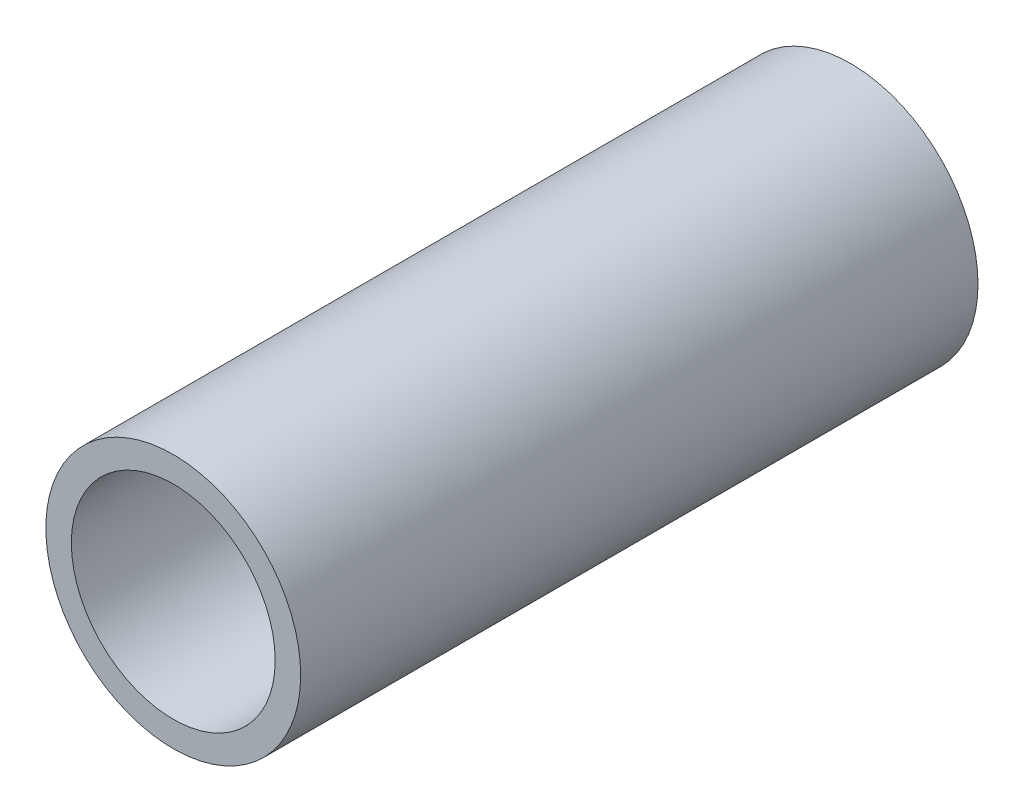
ISO-10303-21;
HEADER;
FILE_DESCRIPTION(('STEP AP214'),'2;1');
FILE_NAME('part.step','',(''),(''),'','','');
FILE_SCHEMA(('AUTOMOTIVE_DESIGN { 1 0 10303 214 1 1 1 1 }'));
ENDSEC;
DATA;
#1=APPLICATION_CONTEXT('core data for automotive mechanical design processes');
#2=APPLICATION_PROTOCOL_DEFINITION('international standard','automotive_design',2000,#1);
#3=PRODUCT_CONTEXT('',#1,'mechanical');
#4=PRODUCT('Part','Part','',(#3));
#5=PRODUCT_RELATED_PRODUCT_CATEGORY('part','',(#4));
#6=PRODUCT_DEFINITION_FORMATION('','',#4);
#7=PRODUCT_DEFINITION_CONTEXT('part definition',#1,'design');
#8=PRODUCT_DEFINITION('design','',#6,#7);
#9=PRODUCT_DEFINITION_SHAPE('','',#8);
#10=(LENGTH_UNIT() NAMED_UNIT(*) SI_UNIT(.MILLI.,.METRE.));
#11=(NAMED_UNIT(*) PLANE_ANGLE_UNIT() SI_UNIT($,.RADIAN.));
#12=(NAMED_UNIT(*) SI_UNIT($,.STERADIAN.) SOLID_ANGLE_UNIT());
#13=UNCERTAINTY_MEASURE_WITH_UNIT(LENGTH_MEASURE(1.E-05),#10,'distance_accuracy_value','');
#14=(GEOMETRIC_REPRESENTATION_CONTEXT(3) GLOBAL_UNCERTAINTY_ASSIGNED_CONTEXT((#13)) GLOBAL_UNIT_ASSIGNED_CONTEXT((#10,
#11,#12)) REPRESENTATION_CONTEXT('',''));
#15=CARTESIAN_POINT('',(0.,0.,0.));
#16=DIRECTION('',(0.,0.,1.));
#17=DIRECTION('',(1.,0.,0.));
#18=AXIS2_PLACEMENT_3D('',#15,#16,#17);
#19=CARTESIAN_POINT('',(0.,0.,6.645));
#20=DIRECTION('',(0.,0.,1.));
#21=DIRECTION('',(1.,0.,0.));
#22=AXIS2_PLACEMENT_3D('',#19,#20,#21);
#23=PLANE('',#22);
#24=CARTESIAN_POINT('',(0.,0.,6.645));
#25=DIRECTION('',(0.,0.,1.));
#26=DIRECTION('',(1.,0.,0.));
#27=AXIS2_PLACEMENT_3D('',#24,#25,#26);
#28=CIRCLE('',#27,1.25);
#29=CARTESIAN_POINT('',(1.25,0.,6.645));
#30=VERTEX_POINT('',#29);
#31=EDGE_CURVE('E10',#30,#30,#28,.T.);
#32=ORIENTED_EDGE('',*,*,#31,.T.);
#33=EDGE_LOOP('',(#32));
#34=FACE_BOUND('',#33,.T.);
#35=CARTESIAN_POINT('',(0.,0.,6.645));
#36=DIRECTION('',(0.,0.,1.));
#37=DIRECTION('',(1.,0.,0.));
#38=AXIS2_PLACEMENT_3D('',#35,#36,#37);
#39=CIRCLE('',#38,1.);
#40=CARTESIAN_POINT('',(1.,0.,6.645));
#41=VERTEX_POINT('',#40);
#42=EDGE_CURVE('E42',#41,#41,#39,.T.);
#43=ORIENTED_EDGE('',*,*,#42,.F.);
#44=EDGE_LOOP('',(#43));
#45=FACE_BOUND('',#44,.T.);
#46=ADVANCED_FACE('F31',(#34,#45),#23,.T.);
#47=CARTESIAN_POINT('',(0.,0.,0.));
#48=DIRECTION('',(0.,0.,1.));
#49=DIRECTION('',(1.,0.,0.));
#50=AXIS2_PLACEMENT_3D('',#47,#48,#49);
#51=PLANE('',#50);
#52=CARTESIAN_POINT('',(0.,0.,0.));
#53=DIRECTION('',(0.,0.,1.));
#54=DIRECTION('',(1.,0.,0.));
#55=AXIS2_PLACEMENT_3D('',#52,#53,#54);
#56=CIRCLE('',#55,1.25);
#57=CARTESIAN_POINT('',(1.25,0.,0.));
#58=VERTEX_POINT('',#57);
#59=EDGE_CURVE('E35',#58,#58,#56,.T.);
#60=ORIENTED_EDGE('',*,*,#59,.F.);
#61=EDGE_LOOP('',(#60));
#62=FACE_BOUND('',#61,.T.);
#63=CARTESIAN_POINT('',(0.,0.,0.));
#64=DIRECTION('',(0.,0.,1.));
#65=DIRECTION('',(1.,0.,0.));
#66=AXIS2_PLACEMENT_3D('',#63,#64,#65);
#67=CIRCLE('',#66,1.);
#68=CARTESIAN_POINT('',(1.,0.,0.));
#69=VERTEX_POINT('',#68);
#70=EDGE_CURVE('E44',#69,#69,#67,.T.);
#71=ORIENTED_EDGE('',*,*,#70,.T.);
#72=EDGE_LOOP('',(#71));
#73=FACE_BOUND('',#72,.T.);
#74=ADVANCED_FACE('F54',(#62,#73),#51,.F.);
#75=CARTESIAN_POINT('',(0.,0.,6.645));
#76=DIRECTION('',(0.,0.,-1.));
#77=DIRECTION('',(-1.,0.,0.));
#78=AXIS2_PLACEMENT_3D('',#75,#76,#77);
#79=CYLINDRICAL_SURFACE('',#78,1.25);
#80=ORIENTED_EDGE('',*,*,#31,.F.);
#81=EDGE_LOOP('',(#80));
#82=FACE_BOUND('',#81,.T.);
#83=ORIENTED_EDGE('',*,*,#59,.T.);
#84=EDGE_LOOP('',(#83));
#85=FACE_BOUND('',#84,.T.);
#86=ADVANCED_FACE('F33',(#82,#85),#79,.T.);
#87=CARTESIAN_POINT('',(0.,0.,6.645));
#88=DIRECTION('',(0.,0.,-1.));
#89=DIRECTION('',(-1.,0.,0.));
#90=AXIS2_PLACEMENT_3D('',#87,#88,#89);
#91=CYLINDRICAL_SURFACE('',#90,1.);
#92=ORIENTED_EDGE('',*,*,#42,.T.);
#93=EDGE_LOOP('',(#92));
#94=FACE_BOUND('',#93,.T.);
#95=ORIENTED_EDGE('',*,*,#70,.F.);
#96=EDGE_LOOP('',(#95));
#97=FACE_BOUND('',#96,.T.);
#98=ADVANCED_FACE('F50',(#94,#97),#91,.F.);
#99=CLOSED_SHELL('',(#46,#74,#86,#98));
#100=MANIFOLD_SOLID_BREP('B2',#99);
#101=ADVANCED_BREP_SHAPE_REPRESENTATION('',(#18,#100),#14);
#102=SHAPE_DEFINITION_REPRESENTATION(#9,#101);
ENDSEC;
END-ISO-10303-21;
